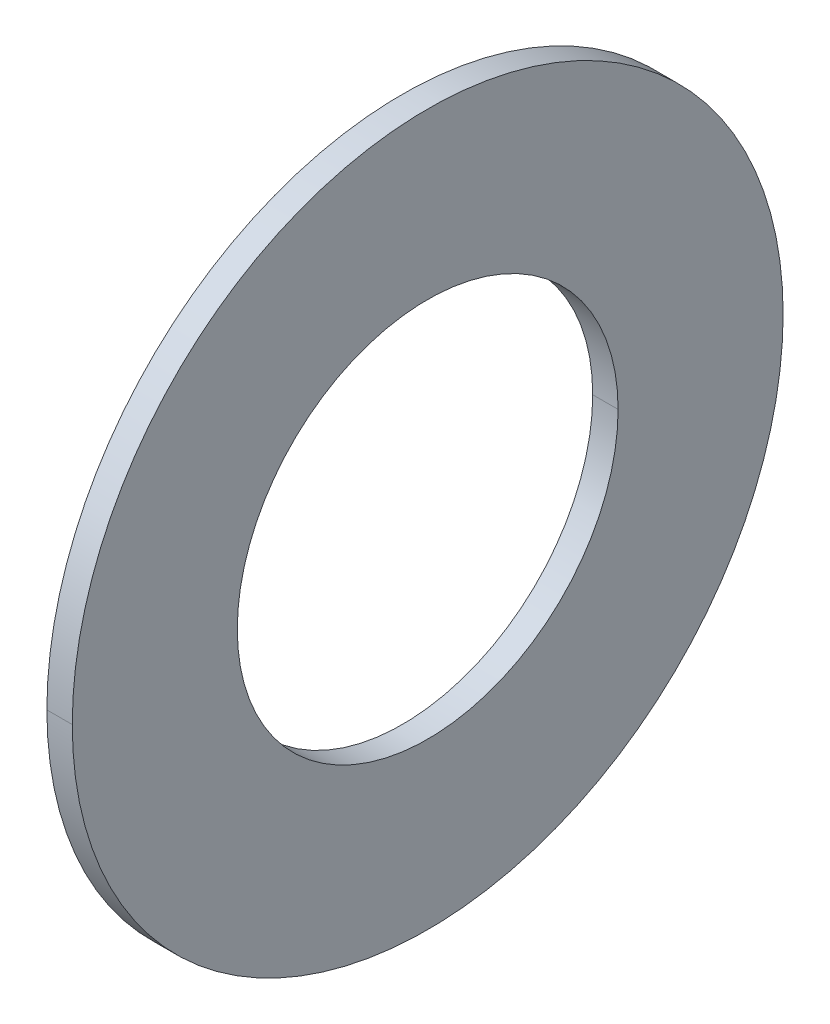
ISO-10303-21;
HEADER;
FILE_DESCRIPTION(('STEP AP214'),'2;1');
FILE_NAME('part.step','',(''),(''),'','','');
FILE_SCHEMA(('AUTOMOTIVE_DESIGN { 1 0 10303 214 1 1 1 1 }'));
ENDSEC;
DATA;
#1=APPLICATION_CONTEXT('core data for automotive mechanical design processes');
#2=APPLICATION_PROTOCOL_DEFINITION('international standard','automotive_design',2000,#1);
#3=PRODUCT_CONTEXT('',#1,'mechanical');
#4=PRODUCT('Part','Part','',(#3));
#5=PRODUCT_RELATED_PRODUCT_CATEGORY('part','',(#4));
#6=PRODUCT_DEFINITION_FORMATION('','',#4);
#7=PRODUCT_DEFINITION_CONTEXT('part definition',#1,'design');
#8=PRODUCT_DEFINITION('design','',#6,#7);
#9=PRODUCT_DEFINITION_SHAPE('','',#8);
#10=(LENGTH_UNIT() NAMED_UNIT(*) SI_UNIT(.MILLI.,.METRE.));
#11=(NAMED_UNIT(*) PLANE_ANGLE_UNIT() SI_UNIT($,.RADIAN.));
#12=(NAMED_UNIT(*) SI_UNIT($,.STERADIAN.) SOLID_ANGLE_UNIT());
#13=UNCERTAINTY_MEASURE_WITH_UNIT(LENGTH_MEASURE(1.E-05),#10,'distance_accuracy_value','');
#14=(GEOMETRIC_REPRESENTATION_CONTEXT(3) GLOBAL_UNCERTAINTY_ASSIGNED_CONTEXT((#13)) GLOBAL_UNIT_ASSIGNED_CONTEXT((#10,
#11,#12)) REPRESENTATION_CONTEXT('',''));
#15=CARTESIAN_POINT('',(0.,0.,0.));
#16=DIRECTION('',(0.,0.,1.));
#17=DIRECTION('',(1.,0.,0.));
#18=AXIS2_PLACEMENT_3D('',#15,#16,#17);
#19=CARTESIAN_POINT('',(-2.,14.,0.));
#20=DIRECTION('',(-1.,0.,0.));
#21=DIRECTION('',(0.,0.,1.));
#22=AXIS2_PLACEMENT_3D('',#19,#20,#21);
#23=PLANE('',#22);
#24=CARTESIAN_POINT('',(-2.,0.,0.));
#25=DIRECTION('',(1.,0.,0.));
#26=DIRECTION('',(0.,0.,-1.));
#27=AXIS2_PLACEMENT_3D('',#24,#25,#26);
#28=CIRCLE('',#27,7.5);
#29=CARTESIAN_POINT('',(-2.,0.,-7.5));
#30=VERTEX_POINT('',#29);
#31=CARTESIAN_POINT('',(-2.,0.,7.5));
#32=VERTEX_POINT('',#31);
#33=EDGE_CURVE('E11',#30,#32,#28,.T.);
#34=ORIENTED_EDGE('',*,*,#33,.T.);
#35=CARTESIAN_POINT('',(-2.,0.,0.));
#36=DIRECTION('',(1.,0.,0.));
#37=DIRECTION('',(0.,0.,-1.));
#38=AXIS2_PLACEMENT_3D('',#35,#36,#37);
#39=CIRCLE('',#38,7.5);
#40=EDGE_CURVE('E25',#32,#30,#39,.T.);
#41=ORIENTED_EDGE('',*,*,#40,.T.);
#42=EDGE_LOOP('',(#34,#41));
#43=FACE_BOUND('',#42,.T.);
#44=CARTESIAN_POINT('',(-2.,0.,0.));
#45=DIRECTION('',(1.,0.,0.));
#46=DIRECTION('',(0.,0.,-1.));
#47=AXIS2_PLACEMENT_3D('',#44,#45,#46);
#48=CIRCLE('',#47,14.);
#49=CARTESIAN_POINT('',(-2.,0.,14.));
#50=VERTEX_POINT('',#49);
#51=CARTESIAN_POINT('',(-2.,0.,-14.));
#52=VERTEX_POINT('',#51);
#53=EDGE_CURVE('E104',#50,#52,#48,.T.);
#54=ORIENTED_EDGE('',*,*,#53,.F.);
#55=CARTESIAN_POINT('',(-2.,0.,0.));
#56=DIRECTION('',(1.,0.,0.));
#57=DIRECTION('',(0.,0.,-1.));
#58=AXIS2_PLACEMENT_3D('',#55,#56,#57);
#59=CIRCLE('',#58,14.);
#60=EDGE_CURVE('E99',#52,#50,#59,.T.);
#61=ORIENTED_EDGE('',*,*,#60,.F.);
#62=EDGE_LOOP('',(#54,#61));
#63=FACE_BOUND('',#62,.T.);
#64=ADVANCED_FACE('F16',(#43,#63),#23,.T.);
#65=CARTESIAN_POINT('',(50.,0.,0.));
#66=DIRECTION('',(1.,0.,0.));
#67=DIRECTION('',(0.,-1.,0.));
#68=AXIS2_PLACEMENT_3D('',#65,#66,#67);
#69=CYLINDRICAL_SURFACE('',#68,14.);
#70=DIRECTION('',(1.,0.,0.));
#71=VECTOR('',#70,1.);
#72=CARTESIAN_POINT('',(-2.,0.,14.));
#73=LINE('',#72,#71);
#74=CARTESIAN_POINT('',(-1.,0.,14.));
#75=VERTEX_POINT('',#74);
#76=EDGE_CURVE('E95',#50,#75,#73,.T.);
#77=ORIENTED_EDGE('',*,*,#76,.T.);
#78=CARTESIAN_POINT('',(-1.,0.,0.));
#79=DIRECTION('',(1.,0.,0.));
#80=DIRECTION('',(0.,0.,-1.));
#81=AXIS2_PLACEMENT_3D('',#78,#79,#80);
#82=CIRCLE('',#81,14.);
#83=CARTESIAN_POINT('',(-1.,0.,-14.));
#84=VERTEX_POINT('',#83);
#85=EDGE_CURVE('E90',#84,#75,#82,.T.);
#86=ORIENTED_EDGE('',*,*,#85,.F.);
#87=DIRECTION('',(1.,0.,0.));
#88=VECTOR('',#87,1.);
#89=CARTESIAN_POINT('',(-2.,0.,-14.));
#90=LINE('',#89,#88);
#91=EDGE_CURVE('E79',#52,#84,#90,.T.);
#92=ORIENTED_EDGE('',*,*,#91,.F.);
#93=ORIENTED_EDGE('',*,*,#60,.T.);
#94=EDGE_LOOP('',(#77,#86,#92,#93));
#95=FACE_BOUND('',#94,.T.);
#96=ADVANCED_FACE('F123',(#95),#69,.T.);
#97=CARTESIAN_POINT('',(50.,0.,0.));
#98=DIRECTION('',(1.,0.,0.));
#99=DIRECTION('',(0.,1.,0.));
#100=AXIS2_PLACEMENT_3D('',#97,#98,#99);
#101=CYLINDRICAL_SURFACE('',#100,14.);
#102=ORIENTED_EDGE('',*,*,#76,.F.);
#103=ORIENTED_EDGE('',*,*,#53,.T.);
#104=ORIENTED_EDGE('',*,*,#91,.T.);
#105=CARTESIAN_POINT('',(-1.,0.,0.));
#106=DIRECTION('',(1.,0.,0.));
#107=DIRECTION('',(0.,0.,-1.));
#108=AXIS2_PLACEMENT_3D('',#105,#106,#107);
#109=CIRCLE('',#108,14.);
#110=EDGE_CURVE('E73',#75,#84,#109,.T.);
#111=ORIENTED_EDGE('',*,*,#110,.F.);
#112=EDGE_LOOP('',(#102,#103,#104,#111));
#113=FACE_BOUND('',#112,.T.);
#114=ADVANCED_FACE('F118',(#113),#101,.T.);
#115=CARTESIAN_POINT('',(-1.,7.5,0.));
#116=DIRECTION('',(1.,0.,0.));
#117=DIRECTION('',(0.,0.,-1.));
#118=AXIS2_PLACEMENT_3D('',#115,#116,#117);
#119=PLANE('',#118);
#120=ORIENTED_EDGE('',*,*,#85,.T.);
#121=ORIENTED_EDGE('',*,*,#110,.T.);
#122=EDGE_LOOP('',(#120,#121));
#123=FACE_BOUND('',#122,.T.);
#124=CARTESIAN_POINT('',(-1.,0.,0.));
#125=DIRECTION('',(1.,0.,0.));
#126=DIRECTION('',(0.,0.,-1.));
#127=AXIS2_PLACEMENT_3D('',#124,#125,#126);
#128=CIRCLE('',#127,7.5);
#129=CARTESIAN_POINT('',(-1.,0.,7.5));
#130=VERTEX_POINT('',#129);
#131=CARTESIAN_POINT('',(-1.,0.,-7.5));
#132=VERTEX_POINT('',#131);
#133=EDGE_CURVE('E58',#130,#132,#128,.T.);
#134=ORIENTED_EDGE('',*,*,#133,.F.);
#135=CARTESIAN_POINT('',(-1.,0.,0.));
#136=DIRECTION('',(1.,0.,0.));
#137=DIRECTION('',(0.,0.,-1.));
#138=AXIS2_PLACEMENT_3D('',#135,#136,#137);
#139=CIRCLE('',#138,7.5);
#140=EDGE_CURVE('E54',#132,#130,#139,.T.);
#141=ORIENTED_EDGE('',*,*,#140,.F.);
#142=EDGE_LOOP('',(#134,#141));
#143=FACE_BOUND('',#142,.T.);
#144=ADVANCED_FACE('F56',(#123,#143),#119,.T.);
#145=CARTESIAN_POINT('',(50.,0.,0.));
#146=DIRECTION('',(1.,0.,0.));
#147=DIRECTION('',(0.,-1.,0.));
#148=AXIS2_PLACEMENT_3D('',#145,#146,#147);
#149=CYLINDRICAL_SURFACE('',#148,7.5);
#150=DIRECTION('',(1.,0.,0.));
#151=VECTOR('',#150,1.);
#152=CARTESIAN_POINT('',(-2.,0.,7.5));
#153=LINE('',#152,#151);
#154=EDGE_CURVE('E63',#32,#130,#153,.T.);
#155=ORIENTED_EDGE('',*,*,#154,.F.);
#156=ORIENTED_EDGE('',*,*,#33,.F.);
#157=DIRECTION('',(1.,0.,0.));
#158=VECTOR('',#157,1.);
#159=CARTESIAN_POINT('',(-2.,0.,-7.5));
#160=LINE('',#159,#158);
#161=EDGE_CURVE('E66',#30,#132,#160,.T.);
#162=ORIENTED_EDGE('',*,*,#161,.T.);
#163=ORIENTED_EDGE('',*,*,#140,.T.);
#164=EDGE_LOOP('',(#155,#156,#162,#163));
#165=FACE_BOUND('',#164,.T.);
#166=ADVANCED_FACE('F67',(#165),#149,.F.);
#167=CARTESIAN_POINT('',(50.,0.,0.));
#168=DIRECTION('',(1.,0.,0.));
#169=DIRECTION('',(0.,1.,0.));
#170=AXIS2_PLACEMENT_3D('',#167,#168,#169);
#171=CYLINDRICAL_SURFACE('',#170,7.5);
#172=ORIENTED_EDGE('',*,*,#154,.T.);
#173=ORIENTED_EDGE('',*,*,#133,.T.);
#174=ORIENTED_EDGE('',*,*,#161,.F.);
#175=ORIENTED_EDGE('',*,*,#40,.F.);
#176=EDGE_LOOP('',(#172,#173,#174,#175));
#177=FACE_BOUND('',#176,.T.);
#178=ADVANCED_FACE('F71',(#177),#171,.F.);
#179=CLOSED_SHELL('',(#64,#96,#114,#144,#166,#178));
#180=MANIFOLD_SOLID_BREP('B1',#179);
#181=ADVANCED_BREP_SHAPE_REPRESENTATION('',(#18,#180),#14);
#182=SHAPE_DEFINITION_REPRESENTATION(#9,#181);
ENDSEC;
END-ISO-10303-21;
